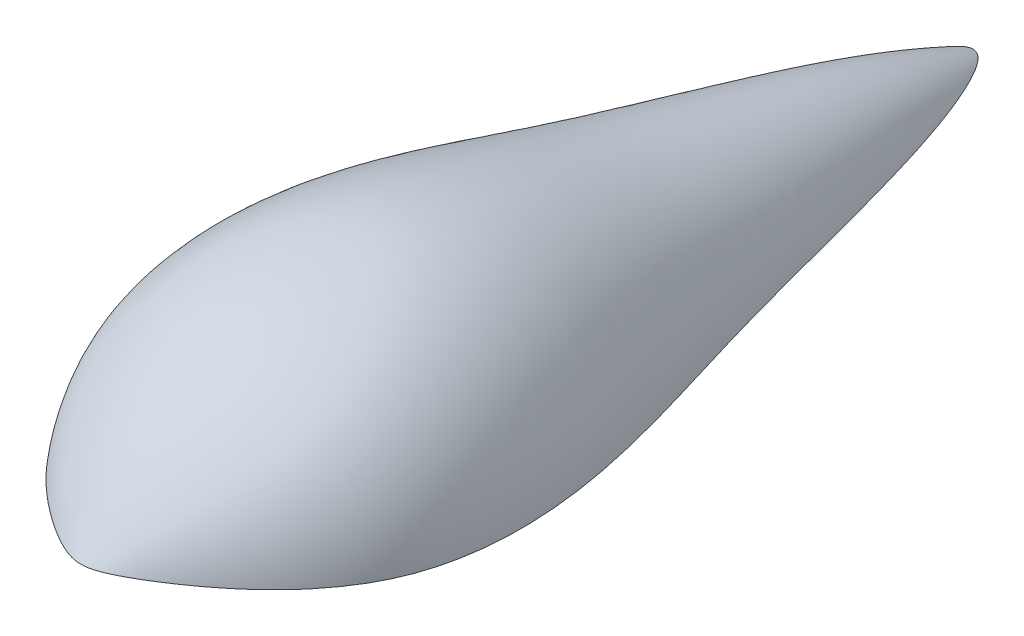
ISO-10303-21;
HEADER;
FILE_DESCRIPTION(('STEP AP214'),'2;1');
FILE_NAME('part.step','',(''),(''),'','','');
FILE_SCHEMA(('AUTOMOTIVE_DESIGN { 1 0 10303 214 1 1 1 1 }'));
ENDSEC;
DATA;
#1=APPLICATION_CONTEXT('core data for automotive mechanical design processes');
#2=APPLICATION_PROTOCOL_DEFINITION('international standard','automotive_design',2000,#1);
#3=PRODUCT_CONTEXT('',#1,'mechanical');
#4=PRODUCT('Part','Part','',(#3));
#5=PRODUCT_RELATED_PRODUCT_CATEGORY('part','',(#4));
#6=PRODUCT_DEFINITION_FORMATION('','',#4);
#7=PRODUCT_DEFINITION_CONTEXT('part definition',#1,'design');
#8=PRODUCT_DEFINITION('design','',#6,#7);
#9=PRODUCT_DEFINITION_SHAPE('','',#8);
#10=(LENGTH_UNIT() NAMED_UNIT(*) SI_UNIT(.MILLI.,.METRE.));
#11=(NAMED_UNIT(*) PLANE_ANGLE_UNIT() SI_UNIT($,.RADIAN.));
#12=(NAMED_UNIT(*) SI_UNIT($,.STERADIAN.) SOLID_ANGLE_UNIT());
#13=UNCERTAINTY_MEASURE_WITH_UNIT(LENGTH_MEASURE(1.E-05),#10,'distance_accuracy_value','');
#14=(GEOMETRIC_REPRESENTATION_CONTEXT(3) GLOBAL_UNCERTAINTY_ASSIGNED_CONTEXT((#13)) GLOBAL_UNIT_ASSIGNED_CONTEXT((#10,
#11,#12)) REPRESENTATION_CONTEXT('',''));
#15=CARTESIAN_POINT('',(0.,0.,0.));
#16=DIRECTION('',(0.,0.,1.));
#17=DIRECTION('',(1.,0.,0.));
#18=AXIS2_PLACEMENT_3D('',#15,#16,#17);
#19=CARTESIAN_POINT('',(0.,-76.835,127.220331340447));
#20=DIRECTION('',(0.,0.,1.));
#21=DIRECTION('',(1.,0.,0.));
#22=AXIS2_PLACEMENT_3D('',#19,#20,#21);
#23=CYLINDRICAL_SURFACE('',#22,78.359);
#24=CARTESIAN_POINT('',(0.,1.524,-0.948397399508818));
#25=CARTESIAN_POINT('',(-0.0468724664831351,1.52400001148209,-0.94839653140969));
#26=CARTESIAN_POINT('',(-0.0937420457764624,1.52395789879976,-0.94978477246184));
#27=CARTESIAN_POINT('',(-0.187320823556759,1.5237900676111,-0.95528515585639));
#28=CARTESIAN_POINT('',(-0.234030021135715,1.52366434863222,-0.959397313594984));
#29=CARTESIAN_POINT('',(-0.327160473103477,1.52333086640331,-0.970206836169312));
#30=CARTESIAN_POINT('',(-0.373581629656452,1.52312307667716,-0.976905035249299));
#31=CARTESIAN_POINT('',(-0.466012258949463,1.52262790612044,-0.992678070242172));
#32=CARTESIAN_POINT('',(-0.512021729521676,1.52234052487101,-1.00175291866221));
#33=CARTESIAN_POINT('',(-0.686996936048974,1.52109484060708,-1.0405229433433));
#34=CARTESIAN_POINT('',(-0.814330205987715,1.51986831913943,-1.07765657255174));
#35=CARTESIAN_POINT('',(-1.06504595955799,1.51686245351777,-1.16353922723403));
#36=CARTESIAN_POINT('',(-1.18842057983939,1.51508207614661,-1.21230992168091));
#37=CARTESIAN_POINT('',(-1.43273529629423,1.51099658112199,-1.31802958051443));
#38=CARTESIAN_POINT('',(-1.55364787321894,1.50868736295143,-1.37504109626736));
#39=CARTESIAN_POINT('',(-1.79257520612239,1.5035844967381,-1.49453224043359));
#40=CARTESIAN_POINT('',(-1.91059209244117,1.50079121780666,-1.55700768458184));
#41=CARTESIAN_POINT('',(-2.18149810219439,1.49377945673262,-1.70654432106038));
#42=CARTESIAN_POINT('',(-2.33354953190328,1.48939016396966,-1.79510875608527));
#43=CARTESIAN_POINT('',(-2.63445712963331,1.47984640786325,-1.97749561176105));
#44=CARTESIAN_POINT('',(-2.78331262216731,1.47469178454829,-2.07131912912162));
#45=CARTESIAN_POINT('',(-3.07842674846754,1.46364622970289,-2.26338686260899));
#46=CARTESIAN_POINT('',(-3.22468118173884,1.4577542123507,-2.36163745823452));
#47=CARTESIAN_POINT('',(-3.51457900619889,1.4452763392833,-2.56188145622178));
#48=CARTESIAN_POINT('',(-3.65822223187187,1.43869043976378,-2.66387509461408));
#49=CARTESIAN_POINT('',(-4.08558848964788,1.41793763295526,-2.9751105612292));
#50=CARTESIAN_POINT('',(-4.36555162493475,1.40278308148684,-3.18947780916565));
#51=CARTESIAN_POINT('',(-4.91512829798132,1.3701793816827,-3.63051302818717));
#52=CARTESIAN_POINT('',(-5.18474886687822,1.35273182922738,-3.85717238037135));
#53=CARTESIAN_POINT('',(-5.71286375532187,1.31591842474876,-4.32238468222069));
#54=CARTESIAN_POINT('',(-5.97137023310005,1.29655474962694,-4.56092398542693));
#55=CARTESIAN_POINT('',(-6.47650089672971,1.25630538406754,-5.04999524826912));
#56=CARTESIAN_POINT('',(-6.72312931888934,1.23542024303881,-5.3005228677612));
#57=CARTESIAN_POINT('',(-7.14382423373808,1.19788750752361,-5.74996560634522));
#58=CARTESIAN_POINT('',(-7.32071243685081,1.18147413781611,-5.94626485695775));
#59=CARTESIAN_POINT('',(-7.66663162513751,1.14824074002578,-6.34566223859913));
#60=CARTESIAN_POINT('',(-7.83566222496785,1.13142069206045,-6.54876070222883));
#61=CARTESIAN_POINT('',(-8.16553892135772,1.09756290270887,-6.96166644117686));
#62=CARTESIAN_POINT('',(-8.32638047769308,1.08052504697405,-7.17147733530819));
#63=CARTESIAN_POINT('',(-8.63932502246287,1.04644655671913,-7.59751842212136));
#64=CARTESIAN_POINT('',(-8.79142813416146,1.02940592224162,-7.8137485241888));
#65=CARTESIAN_POINT('',(-9.08578302443597,0.995606347140301,-8.25153829866445));
#66=CARTESIAN_POINT('',(-9.22807290085769,0.978846533678834,-8.47307226655949));
#67=CARTESIAN_POINT('',(-9.50294130065644,0.945756942735801,-8.92212746921113));
#68=CARTESIAN_POINT('',(-9.63551967911451,0.929427171673833,-9.14964879324469));
#69=CARTESIAN_POINT('',(-9.89030533542956,0.897433508869478,-9.61033289387004));
#70=CARTESIAN_POINT('',(-10.0125176633791,0.881769294761585,-9.84349285147334));
#71=CARTESIAN_POINT('',(-10.2460081377779,0.851331241758164,-10.3152793092441));
#72=CARTESIAN_POINT('',(-10.3572866510627,0.83655737299749,-10.5539056256807));
#73=CARTESIAN_POINT('',(-10.5679561659001,0.808173857334879,-11.0356707505229));
#74=CARTESIAN_POINT('',(-10.667377956593,0.794561222392509,-11.2787958899365));
#75=CARTESIAN_POINT('',(-10.8540293679216,0.768684413883579,-11.7697507176146));
#76=CARTESIAN_POINT('',(-10.9412589673749,0.756420242659813,-12.0175804140518));
#77=CARTESIAN_POINT('',(-11.1039925878036,0.733298782173674,-12.5171691723002));
#78=CARTESIAN_POINT('',(-11.1794941250644,0.722441790997769,-12.7689290540382));
#79=CARTESIAN_POINT('',(-11.3192357652562,0.702170227996523,-13.2756099912637));
#80=CARTESIAN_POINT('',(-11.3834755393843,0.692755698286877,-13.5305311388161));
#81=CARTESIAN_POINT('',(-11.5013750780463,0.675352959743695,-14.043503662658));
#82=CARTESIAN_POINT('',(-11.5550086967674,0.667368280173418,-14.30156115002));
#83=CARTESIAN_POINT('',(-11.6520631199199,0.652835738325076,-14.8196082987281));
#84=CARTESIAN_POINT('',(-11.6954840546758,0.646287857712032,-15.0795979353742));
#85=CARTESIAN_POINT('',(-11.8112997209692,0.628748672733815,-15.8617791508864));
#86=CARTESIAN_POINT('',(-11.869250132937,0.619861403826584,-16.3861955899458));
#87=CARTESIAN_POINT('',(-11.9541002845169,0.606812219244942,-17.4764170380482));
#88=CARTESIAN_POINT('',(-11.978393551766,0.6030473333284,-18.042420948851));
#89=CARTESIAN_POINT('',(-11.9891857757004,0.601375445955508,-18.8917619212849));
#90=CARTESIAN_POINT('',(-11.9885046272374,0.601481335107266,-19.1750141000903));
#91=CARTESIAN_POINT('',(-11.9791522245257,0.602928910859209,-19.741389945042));
#92=CARTESIAN_POINT('',(-11.9704810141381,0.604270590675601,-20.0245136118851));
#93=CARTESIAN_POINT('',(-11.9455362182696,0.608122352284757,-20.5904570062297));
#94=CARTESIAN_POINT('',(-11.9292614325166,0.610632618546037,-20.8732766786764));
#95=CARTESIAN_POINT('',(-11.8895298908439,0.616742129685971,-21.4383917736457));
#96=CARTESIAN_POINT('',(-11.8660731399999,0.620341373795026,-21.7206871965386));
#97=CARTESIAN_POINT('',(-11.7853889580282,0.632673860885607,-22.5686421833975));
#98=CARTESIAN_POINT('',(-11.7179436129135,0.642926780855101,-23.1333273772363));
#99=CARTESIAN_POINT('',(-11.559633868451,0.666703850497405,-24.2590785237115));
#100=CARTESIAN_POINT('',(-11.4687765454067,0.680227011659339,-24.8201455175215));
#101=CARTESIAN_POINT('',(-11.2674591442417,0.709745614010291,-25.9385352374971));
#102=CARTESIAN_POINT('',(-11.1570029102363,0.725740570304062,-26.4958586757134));
#103=CARTESIAN_POINT('',(-10.9244823242073,0.758826082190511,-27.5871249703494));
#104=CARTESIAN_POINT('',(-10.8029758550672,0.775856829765135,-28.1211899303528));
#105=CARTESIAN_POINT('',(-10.548520324215,0.810850384148069,-29.1865157198719));
#106=CARTESIAN_POINT('',(-10.4155716163274,0.828813162128711,-29.7177766355572));
#107=CARTESIAN_POINT('',(-10.141387672588,0.865091747573521,-30.7782791921675));
#108=CARTESIAN_POINT('',(-10.0001502071593,0.883407649125835,-31.3075202486241));
#109=CARTESIAN_POINT('',(-9.71250114477792,0.919879126060946,-32.3647558950724));
#110=CARTESIAN_POINT('',(-9.56608804463688,0.938034652919531,-32.8927500746308));
#111=CARTESIAN_POINT('',(-9.27118129750362,0.973740654235605,-33.9482569608583));
#112=CARTESIAN_POINT('',(-9.12268734995157,0.991291039992118,-34.4757695860023));
#113=CARTESIAN_POINT('',(-8.90072113291136,1.01688260638653,-35.2672616722052));
#114=CARTESIAN_POINT('',(-8.82686389770147,1.025290531961,-35.53112098482));
#115=CARTESIAN_POINT('',(-8.67978529401402,1.04182372818652,-36.0590254994262));
#116=CARTESIAN_POINT('',(-8.60656392445709,1.04994899931745,-36.3230707011012));
#117=CARTESIAN_POINT('',(-8.46135931493539,1.06585754383836,-36.8508434212048));
#118=CARTESIAN_POINT('',(-8.38937356719883,1.07364157691192,-37.1145702253812));
#119=CARTESIAN_POINT('',(-8.24669339931136,1.08887364339051,-37.6423827584224));
#120=CARTESIAN_POINT('',(-8.17599898001978,1.09632167657194,-37.9064684875259));
#121=CARTESIAN_POINT('',(-8.03571450841512,1.11091165071627,-38.4348965340667));
#122=CARTESIAN_POINT('',(-7.96612428343592,1.11805363983923,-38.6992388043888));
#123=CARTESIAN_POINT('',(-7.82790814487641,1.1320543118083,-39.228182815809));
#124=CARTESIAN_POINT('',(-7.75928223188253,1.13891299448214,-39.4927845570646));
#125=CARTESIAN_POINT('',(-7.55463727682011,1.15909691164179,-40.2868747940556));
#126=CARTESIAN_POINT('',(-7.41984049825899,1.17203110721229,-40.8166881078368));
#127=CARTESIAN_POINT('',(-7.15232193022115,1.19701402623629,-41.8768385049345));
#128=CARTESIAN_POINT('',(-7.01960007356216,1.2090627784058,-42.4071755706993));
#129=CARTESIAN_POINT('',(-6.75500310712789,1.23240967385989,-43.4680656145658));
#130=CARTESIAN_POINT('',(-6.62312798064113,1.24370783199995,-43.9986185881851));
#131=CARTESIAN_POINT('',(-6.35896890504119,1.26566559628133,-45.0596254607856));
#132=CARTESIAN_POINT('',(-6.22668496389839,1.27632521479026,-45.5900793614871));
#133=CARTESIAN_POINT('',(-5.99331308972708,1.294528180456,-46.5195410389192));
#134=CARTESIAN_POINT('',(-5.89259407865054,1.30219067319283,-46.9186389191839));
#135=CARTESIAN_POINT('',(-5.68962335222698,1.31723239626547,-47.7164605178853));
#136=CARTESIAN_POINT('',(-5.5873716021928,1.32461162017717,-48.1151842276366));
#137=CARTESIAN_POINT('',(-5.38073880908328,1.33910860039987,-48.9121173872298));
#138=CARTESIAN_POINT('',(-5.27635760620179,1.3462263369743,-49.3103267960736));
#139=CARTESIAN_POINT('',(-5.06487825134375,1.36021167381201,-50.1060945678907));
#140=CARTESIAN_POINT('',(-4.95777968794152,1.36707923580923,-50.5036528224572));
#141=CARTESIAN_POINT('',(-4.73984109623148,1.38059136178297,-51.2985258178379));
#142=CARTESIAN_POINT('',(-4.62899462622143,1.38723549811745,-51.6958388051411));
#143=CARTESIAN_POINT('',(-4.40274868682945,1.40029591768544,-52.4891603294755));
#144=CARTESIAN_POINT('',(-4.28734936980318,1.4067122085299,-52.8851689096775));
#145=CARTESIAN_POINT('',(-4.05094044949312,1.41930833796559,-53.6754186554075));
#146=CARTESIAN_POINT('',(-3.92993212713858,1.42548822996057,-54.0696602021385));
#147=CARTESIAN_POINT('',(-3.68106627261295,1.4375888730852,-54.8558670406615));
#148=CARTESIAN_POINT('',(-3.55321072872294,1.44350969854434,-55.2478329569944));
#149=CARTESIAN_POINT('',(-3.33226117997174,1.45316520197295,-55.9011578789193));
#150=CARTESIAN_POINT('',(-3.24147780955582,1.45698142850046,-56.1632968830743));
#151=CARTESIAN_POINT('',(-3.05544602400651,1.46446238066686,-56.6860614719576));
#152=CARTESIAN_POINT('',(-2.96019659145828,1.46812707142299,-56.9466866964841));
#153=CARTESIAN_POINT('',(-2.76437549080505,1.4752848653599,-57.4661494425736));
#154=CARTESIAN_POINT('',(-2.66380007783706,1.47877784438581,-57.7249855576222));
#155=CARTESIAN_POINT('',(-2.45652826968123,1.48555351859386,-58.2394191747911));
#156=CARTESIAN_POINT('',(-2.34984890363893,1.48883674944417,-58.4950234701779));
#157=CARTESIAN_POINT('',(-2.1837258189012,1.49358528672758,-58.87569584183));
#158=CARTESIAN_POINT('',(-2.1273479330358,1.4951384070775,-59.0021018857335));
#159=CARTESIAN_POINT('',(-2.01220038783335,1.49818105124952,-59.2538183822221));
#160=CARTESIAN_POINT('',(-1.95343082917842,1.49967057774333,-59.3791288806571));
#161=CARTESIAN_POINT('',(-1.83309849527471,1.50257878275546,-59.6282488542885));
#162=CARTESIAN_POINT('',(-1.77153863272742,1.50399753204666,-59.7520597312144));
#163=CARTESIAN_POINT('',(-1.64491659853824,1.50675864959359,-59.9978706699493));
#164=CARTESIAN_POINT('',(-1.57985490049103,1.50810102812758,-60.1198709737908));
#165=CARTESIAN_POINT('',(-1.46286747731338,1.51035955262588,-60.3296944273736));
#166=CARTESIAN_POINT('',(-1.41197180778172,1.51129515138465,-60.418089471273));
#167=CARTESIAN_POINT('',(-1.30707744800878,1.51311539075373,-60.5930906516168));
#168=CARTESIAN_POINT('',(-1.25307715713129,1.51400000459874,-60.679695833417));
#169=CARTESIAN_POINT('',(-1.1409320237417,1.51571360122258,-60.8506067064321));
#170=CARTESIAN_POINT('',(-1.08277490827024,1.51654240394529,-60.9349044787709));
#171=CARTESIAN_POINT('',(-0.991515475164279,1.51773253591835,-61.0583319504734));
#172=CARTESIAN_POINT('',(-0.960437322645537,1.51812026709845,-61.0989567190099));
#173=CARTESIAN_POINT('',(-0.896677763222452,1.5188758995006,-61.1789234146186));
#174=CARTESIAN_POINT('',(-0.863996673468273,1.51924380461535,-61.2182655929147));
#175=CARTESIAN_POINT('',(-0.796230377759706,1.51996195683433,-61.295835829354));
#176=CARTESIAN_POINT('',(-0.761117423023285,1.52031187518076,-61.3340398298019));
#177=CARTESIAN_POINT('',(-0.688515819293805,1.52098346584493,-61.4081017298773));
#178=CARTESIAN_POINT('',(-0.651028637484006,1.5213051553194,-61.4439610511112));
#179=CARTESIAN_POINT('',(-0.57342812099367,1.52191135721029,-61.5121831461034));
#180=CARTESIAN_POINT('',(-0.533335219070676,1.52219611630685,-61.5445688405103));
#181=CARTESIAN_POINT('',(-0.449824507717017,1.52271996051572,-61.6046561089068));
#182=CARTESIAN_POINT('',(-0.406414192743658,1.52295914455001,-61.6323678125492));
#183=CARTESIAN_POINT('',(-0.323896320469744,1.52333942106105,-61.6767250525025));
#184=CARTESIAN_POINT('',(-0.285386654372291,1.52349038171254,-61.694461061078));
#185=CARTESIAN_POINT('',(-0.206079666649588,1.52373899933512,-61.7237829110424));
#186=CARTESIAN_POINT('',(-0.165285625701362,1.52383673069022,-61.7353773342192));
#187=CARTESIAN_POINT('',(-0.0817848922628741,1.52396851237134,-61.7510325435912));
#188=CARTESIAN_POINT('',(-0.0390629035217387,1.52400190107103,-61.755015054208));
#189=CARTESIAN_POINT('',(0.0463469663572763,1.52399792965116,-61.7545420603936));
#190=CARTESIAN_POINT('',(0.0890348361184609,1.52396055161365,-61.7500844189394));
#191=CARTESIAN_POINT('',(0.167793408942823,1.52382907710515,-61.7344704329201));
#192=CARTESIAN_POINT('',(0.204044763138016,1.5237423015209,-61.7241793354485));
#193=CARTESIAN_POINT('',(0.274751941657951,1.52352629934616,-61.6986914225097));
#194=CARTESIAN_POINT('',(0.309207209350898,1.52339705968503,-61.6834930966002));
#195=CARTESIAN_POINT('',(0.374106528896515,1.52311327094051,-61.650323095003));
#196=CARTESIAN_POINT('',(0.404667154143173,1.52296072356877,-61.6325745485318));
#197=CARTESIAN_POINT('',(0.464129441442406,1.52263108680618,-61.5944644871982));
#198=CARTESIAN_POINT('',(0.493029668361854,1.52245397662319,-61.5741007597064));
#199=CARTESIAN_POINT('',(0.549396474705591,1.52207908189851,-61.5312875101675));
#200=CARTESIAN_POINT('',(0.576857284419299,1.52188122246957,-61.5088304678414));
#201=CARTESIAN_POINT('',(0.630390516450103,1.5214688047327,-61.4623500435018));
#202=CARTESIAN_POINT('',(0.656463415280328,1.52125425221911,-61.4383272054588));
#203=CARTESIAN_POINT('',(0.735371497092838,1.52056761543455,-61.3620023916471));
#204=CARTESIAN_POINT('',(0.786172816461445,1.52007132341177,-61.3076001227529));
#205=CARTESIAN_POINT('',(0.883846069411396,1.51903039342239,-61.1952681333518));
#206=CARTESIAN_POINT('',(0.930709894343189,1.51848566022562,-61.1373315381821));
#207=CARTESIAN_POINT('',(1.02136882354143,1.51735632620857,-61.0190293987421));
#208=CARTESIAN_POINT('',(1.06516083394579,1.51677168633182,-60.9586614993518));
#209=CARTESIAN_POINT('',(1.15050063909049,1.51556514458838,-60.8358849470182));
#210=CARTESIAN_POINT('',(1.19203488486023,1.51494305681322,-60.773466956278));
#211=CARTESIAN_POINT('',(1.2730178991569,1.51366905821998,-60.6474161036486));
#212=CARTESIAN_POINT('',(1.31246937117713,1.5130171882192,-60.5837849702418));
#213=CARTESIAN_POINT('',(1.38967009183285,1.5116858694266,-60.4555449874786));
#214=CARTESIAN_POINT('',(1.42742016052268,1.51100643422752,-60.3909366296289));
#215=CARTESIAN_POINT('',(1.50769516031097,1.50950591657647,-60.250034128684));
#216=CARTESIAN_POINT('',(1.54996223945689,1.50868015441668,-60.1735934080642));
#217=CARTESIAN_POINT('',(1.63286571098243,1.50699605830857,-60.0198315734099));
#218=CARTESIAN_POINT('',(1.67350201714134,1.50613772264272,-59.9425104131024));
#219=CARTESIAN_POINT('',(1.79334071155933,1.50351679426169,-59.7094421355619));
#220=CARTESIAN_POINT('',(1.87045544472393,1.50170861177109,-59.5526213308713));
#221=CARTESIAN_POINT('',(2.02053581282705,1.49798121685375,-59.2366620026523));
#222=CARTESIAN_POINT('',(2.09349329986388,1.49606180032056,-59.0775196469201));
#223=CARTESIAN_POINT('',(2.23591258404599,1.49212588454275,-58.7576747828351));
#224=CARTESIAN_POINT('',(2.30537421868805,1.49010938079357,-58.5969722023693));
#225=CARTESIAN_POINT('',(2.44142105164584,1.48598683185552,-58.2741876698705));
#226=CARTESIAN_POINT('',(2.50800358951071,1.48388070727219,-58.1121046009861));
#227=CARTESIAN_POINT('',(2.63862905688315,1.47958856543067,-57.7869171275934));
#228=CARTESIAN_POINT('',(2.70267191830706,1.47740254603368,-57.62381269584));
#229=CARTESIAN_POINT('',(2.89138139749272,1.47073842946389,-57.1334396490902));
#230=CARTESIAN_POINT('',(3.012720881112,1.4661514386941,-56.8048903842626));
#231=CARTESIAN_POINT('',(3.24811632312118,1.45673933736487,-56.1456955489252));
#232=CARTESIAN_POINT('',(3.36218151572627,1.45191454306178,-55.8150532464594));
#233=CARTESIAN_POINT('',(3.5843303891421,1.44205799329014,-55.1519945665638));
#234=CARTESIAN_POINT('',(3.69241762460888,1.43702636398321,-54.819579375141));
#235=CARTESIAN_POINT('',(3.90263475560902,1.42682526025132,-54.1562903294098));
#236=CARTESIAN_POINT('',(4.0048108281863,1.42165751015065,-53.8254310354612));
#237=CARTESIAN_POINT('',(4.20503836327019,1.4111536475177,-53.1624672343577));
#238=CARTESIAN_POINT('',(4.3030897593228,1.40581753227523,-52.8303627072343));
#239=CARTESIAN_POINT('',(4.59214243489316,1.3895647402661,-51.8322701358992));
#240=CARTESIAN_POINT('',(4.77795460989626,1.37840794114761,-51.1647836095244));
#241=CARTESIAN_POINT('',(5.04988865912636,1.36116153298725,-50.161537354633));
#242=CARTESIAN_POINT('',(5.1394285230064,1.35532569834006,-49.8266849446071));
#243=CARTESIAN_POINT('',(5.31666707627031,1.34347422293196,-49.1564947210746));
#244=CARTESIAN_POINT('',(5.40436576481521,1.33745858208913,-48.8211569073469));
#245=CARTESIAN_POINT('',(5.66530676446965,1.31912759159994,-47.814257826806));
#246=CARTESIAN_POINT('',(5.83631022138151,1.30653351902441,-47.1421228034978));
#247=CARTESIAN_POINT('',(6.17515779343396,1.28048603567466,-45.7969209739043));
#248=CARTESIAN_POINT('',(6.34300119976311,1.26703243500936,-45.1238539940826));
#249=CARTESIAN_POINT('',(6.67811461145613,1.2390927155011,-43.7776568260867));
#250=CARTESIAN_POINT('',(6.84538466244335,1.22460668090913,-43.1045266475366));
#251=CARTESIAN_POINT('',(7.09768283440592,1.20193270651916,-42.0956310257001));
#252=CARTESIAN_POINT('',(7.18196313325081,1.19422216494586,-41.7596682401595));
#253=CARTESIAN_POINT('',(7.35133025087011,1.17844798463561,-41.0879538383142));
#254=CARTESIAN_POINT('',(7.43641707017537,1.17038434566625,-40.7522022221488));
#255=CARTESIAN_POINT('',(7.60767496239873,1.15386817319227,-40.0810988278378));
#256=CARTESIAN_POINT('',(7.69384568111981,1.14541576444845,-39.7457469563657));
#257=CARTESIAN_POINT('',(7.86759977107407,1.12807701238528,-39.0754207824356));
#258=CARTESIAN_POINT('',(7.95518314019122,1.11919066971588,-38.740446479413));
#259=CARTESIAN_POINT('',(8.13203153560474,1.10094066634462,-38.0710214324771));
#260=CARTESIAN_POINT('',(8.2212962434965,1.09157709545645,-37.7365706021695));
#261=CARTESIAN_POINT('',(8.35670607347997,1.07713257074614,-37.2353148571116));
#262=CARTESIAN_POINT('',(8.4020948165999,1.07225120055135,-37.06829967372));
#263=CARTESIAN_POINT('',(8.4933605658721,1.06235435211383,-36.734406704741));
#264=CARTESIAN_POINT('',(8.53923757223984,1.05733887381192,-36.5675289192143));
#265=CARTESIAN_POINT('',(8.67742761159984,1.04210646669821,-36.0670643883605));
#266=CARTESIAN_POINT('',(8.77030185125984,1.03170333267447,-35.733638409426));
#267=CARTESIAN_POINT('',(8.95676998080582,1.01047489453037,-35.0670013407202));
#268=CARTESIAN_POINT('',(9.05036387242191,0.999649589394822,-34.7337902514677));
#269=CARTESIAN_POINT('',(9.23749063559817,0.977662952432872,-34.0673582437689));
#270=CARTESIAN_POINT('',(9.33102350660932,0.966501617624568,-33.7341373252617));
#271=CARTESIAN_POINT('',(9.51725277018501,0.943940615304212,-33.067470666765));
#272=CARTESIAN_POINT('',(9.60994916168777,0.932540947489693,-32.7340249264908));
#273=CARTESIAN_POINT('',(9.88563266465879,0.898141390753591,-31.7329905661999));
#274=CARTESIAN_POINT('',(10.0662064432601,0.874941850732371,-31.0647316126774));
#275=CARTESIAN_POINT('',(10.3342178396086,0.839615368424783,-30.03411341981));
#276=CARTESIAN_POINT('',(10.4261717513267,0.827320501731919,-29.672938499694));
#277=CARTESIAN_POINT('',(10.6053843701539,0.803050299861635,-28.9494363715228));
#278=CARTESIAN_POINT('',(10.6926433960454,0.791074943017434,-28.5871092434761));
#279=CARTESIAN_POINT('',(10.8614489608937,0.767635760471982,-27.8611253644803));
#280=CARTESIAN_POINT('',(10.9429958103346,0.75617190698041,-27.4974686869309));
#281=CARTESIAN_POINT('',(11.0993499845221,0.733959943505134,-26.7686456711202));
#282=CARTESIAN_POINT('',(11.1741566842586,0.723211899922118,-26.4034791961334));
#283=CARTESIAN_POINT('',(11.3161175501676,0.702626499754891,-25.6708091071764));
#284=CARTESIAN_POINT('',(11.383254838142,0.692791160365552,-25.3033021487348));
#285=CARTESIAN_POINT('',(11.5086205317577,0.674280425915454,-24.5666882449862));
#286=CARTESIAN_POINT('',(11.566847843528,0.665605173294121,-24.1975811089379));
#287=CARTESIAN_POINT('',(11.673300093396,0.649642666199501,-23.4579025189119));
#288=CARTESIAN_POINT('',(11.7215255075469,0.642355345667144,-23.087331135483));
#289=CARTESIAN_POINT('',(11.806910344872,0.629389288690273,-22.3448825476645));
#290=CARTESIAN_POINT('',(11.844069598911,0.623710576831773,-21.9730053234043));
#291=CARTESIAN_POINT('',(11.9173947652053,0.612469067540314,-21.09504634601));
#292=CARTESIAN_POINT('',(11.9484581421042,0.607673216308523,-20.5885062549459));
#293=CARTESIAN_POINT('',(11.9765059720569,0.603338381295354,-19.8279924328949));
#294=CARTESIAN_POINT('',(11.9827637262218,0.602369974996935,-19.5743439155941));
#295=CARTESIAN_POINT('',(11.9888047603923,0.601434873633254,-19.0669694377283));
#296=CARTESIAN_POINT('',(11.9885880532925,0.601468176572966,-18.8132434773187));
#297=CARTESIAN_POINT('',(11.9775839695099,0.603172199656008,-18.051873245539));
#298=CARTESIAN_POINT('',(11.9564311811245,0.606448808169416,-17.5443233001419));
#299=CARTESIAN_POINT('',(11.8830642567206,0.617740821449344,-16.5343503477584));
#300=CARTESIAN_POINT('',(11.831026302078,0.625729345968167,-16.031914576018));
#301=CARTESIAN_POINT('',(11.692157128841,0.646812795417652,-15.0321381412563));
#302=CARTESIAN_POINT('',(11.6053432601485,0.659905173919198,-14.5347950641649));
#303=CARTESIAN_POINT('',(11.3929876472516,0.691410454773229,-13.5490908538631));
#304=CARTESIAN_POINT('',(11.2674940693818,0.709816738131722,-13.0607193457109));
#305=CARTESIAN_POINT('',(11.0224338967891,0.744949626119773,-12.2559468731106));
#306=CARTESIAN_POINT('',(10.9145460956441,0.760230375604002,-11.9359176348872));
#307=CARTESIAN_POINT('',(10.7376675353382,0.784835745262712,-11.4615792221591));
#308=CARTESIAN_POINT('',(10.6761939264134,0.793319091377171,-11.3044032818573));
#309=CARTESIAN_POINT('',(10.548329613441,0.810796988883584,-10.9920924906136));
#310=CARTESIAN_POINT('',(10.4819388035568,0.819791551277852,-10.8369576836892));
#311=CARTESIAN_POINT('',(10.2756880942784,0.847445653339363,-10.374758253662));
#312=CARTESIAN_POINT('',(10.1287381647889,0.866777257003873,-10.0708672515685));
#313=CARTESIAN_POINT('',(9.81708879327438,0.906767192457532,-9.47181354754614));
#314=CARTESIAN_POINT('',(9.65235978783917,0.927427710212653,-9.17666645671912));
#315=CARTESIAN_POINT('',(9.3066224414947,0.969562737075809,-8.59609525572517));
#316=CARTESIAN_POINT('',(9.12561261691268,0.991037320266337,-8.31067203497005));
#317=CARTESIAN_POINT('',(8.74852181770138,1.03432819268902,-7.75003986298299));
#318=CARTESIAN_POINT('',(8.55244133101304,1.05614447083997,-7.47483058148307));
#319=CARTESIAN_POINT('',(8.0470980982099,1.11029774489232,-6.803251993219));
#320=CARTESIAN_POINT('',(7.72928457754124,1.14257525714658,-6.41327109573776));
#321=CARTESIAN_POINT('',(7.06553848648034,1.2055157916084,-5.65799347316039));
#322=CARTESIAN_POINT('',(6.71960465284759,1.23617874118337,-5.29269785834539));
#323=CARTESIAN_POINT('',(6.00364827049992,1.29449462240941,-4.58719954251891));
#324=CARTESIAN_POINT('',(5.63365616301494,1.32215124395907,-4.24696624985642));
#325=CARTESIAN_POINT('',(5.06257380072601,1.36052214993764,-3.75532679471209));
#326=CARTESIAN_POINT('',(4.86954321516895,1.37279277783507,-3.59457485386463));
#327=CARTESIAN_POINT('',(4.47830576679766,1.39617053825496,-3.27941886004972));
#328=CARTESIAN_POINT('',(4.28009931661232,1.4072777631743,-3.12501430356886));
#329=CARTESIAN_POINT('',(3.91530773317313,1.42629463792471,-2.85050527698998));
#330=CARTESIAN_POINT('',(3.74956725897641,1.43441760915808,-2.72929128574998));
#331=CARTESIAN_POINT('',(3.4146113659381,1.44974576131998,-2.49169266469334));
#332=CARTESIAN_POINT('',(3.24539591737673,1.45695093439522,-2.375308076206));
#333=CARTESIAN_POINT('',(2.90296867333417,1.47039622382364,-2.14786228050881));
#334=CARTESIAN_POINT('',(2.72975085193562,1.47663475904388,-2.03680999587899));
#335=CARTESIAN_POINT('',(2.4667281387958,1.48521335174974,-1.87544526450892));
#336=CARTESIAN_POINT('',(2.37852965167796,1.48794279503514,-1.82253068403546));
#337=CARTESIAN_POINT('',(2.20093597317911,1.49313450285838,-1.71873969267028));
#338=CARTESIAN_POINT('',(2.11154084094544,1.49559678054721,-1.66786318153424));
#339=CARTESIAN_POINT('',(1.91592983366286,1.50064477857635,-1.56003581365382));
#340=CARTESIAN_POINT('',(1.80945989706381,1.50317917613083,-1.50354073644829));
#341=CARTESIAN_POINT('',(1.59423357539052,1.50785475825443,-1.39490645354745));
#342=CARTESIAN_POINT('',(1.48547625255634,1.50999577790483,-1.34276907973449));
#343=CARTESIAN_POINT('',(1.26559598984394,1.51385581045413,-1.24467103756274));
#344=CARTESIAN_POINT('',(1.15448184342546,1.51557616647356,-1.19869092839933));
#345=CARTESIAN_POINT('',(0.92908614866174,1.51857268884823,-1.11530187690687));
#346=CARTESIAN_POINT('',(0.814808021033358,1.51984931613458,-1.0778840542424));
#347=CARTESIAN_POINT('',(0.6418716722373,1.52139176823194,-1.03122773682831));
#348=CARTESIAN_POINT('',(0.584470495604516,1.52184153022522,-1.01733373554601));
#349=CARTESIAN_POINT('',(0.46892616352803,1.52261817110115,-0.993022011575373));
#350=CARTESIAN_POINT('',(0.410783037952448,1.52294505491439,-0.982604149406025));
#351=CARTESIAN_POINT('',(0.294022789274428,1.52347008006336,-0.965725900592134));
#352=CARTESIAN_POINT('',(0.235406693051394,1.52366844932698,-0.959258508734274));
#353=CARTESIAN_POINT('',(0.117858849715579,1.52393339378685,-0.950595072573447));
#354=CARTESIAN_POINT('',(0.0589271432525763,1.52399998556495,-0.948398490865973));
#355=CARTESIAN_POINT('',(0.,1.524,-0.948397399508818));
#356=B_SPLINE_CURVE_WITH_KNOTS('',3,(#24,#25,#26,#27,#28,#29,#30,#31,#32,#33,#34,#35,#36,#37,
#38,#39,#40,#41,#42,#43,#44,#45,#46,#47,#48,#49,#50,#51,#52,#53,#54,#55,#56,#57,#58,#59,#60,#61,
#62,#63,#64,#65,#66,#67,#68,#69,#70,#71,#72,#73,#74,#75,#76,#77,#78,#79,#80,#81,#82,#83,#84,#85,
#86,#87,#88,#89,#90,#91,#92,#93,#94,#95,#96,#97,#98,#99,#100,#101,#102,#103,#104,#105,#106,#107,
#108,#109,#110,#111,#112,#113,#114,#115,#116,#117,#118,#119,#120,#121,#122,#123,#124,#125,#126,
#127,#128,#129,#130,#131,#132,#133,#134,#135,#136,#137,#138,#139,#140,#141,#142,#143,#144,#145,
#146,#147,#148,#149,#150,#151,#152,#153,#154,#155,#156,#157,#158,#159,#160,#161,#162,#163,#164,
#165,#166,#167,#168,#169,#170,#171,#172,#173,#174,#175,#176,#177,#178,#179,#180,#181,#182,#183,
#184,#185,#186,#187,#188,#189,#190,#191,#192,#193,#194,#195,#196,#197,#198,#199,#200,#201,#202,
#203,#204,#205,#206,#207,#208,#209,#210,#211,#212,#213,#214,#215,#216,#217,#218,#219,#220,#221,
#222,#223,#224,#225,#226,#227,#228,#229,#230,#231,#232,#233,#234,#235,#236,#237,#238,#239,#240,
#241,#242,#243,#244,#245,#246,#247,#248,#249,#250,#251,#252,#253,#254,#255,#256,#257,#258,#259,
#260,#261,#262,#263,#264,#265,#266,#267,#268,#269,#270,#271,#272,#273,#274,#275,#276,#277,#278,
#279,#280,#281,#282,#283,#284,#285,#286,#287,#288,#289,#290,#291,#292,#293,#294,#295,#296,#297,
#298,#299,#300,#301,#302,#303,#304,#305,#306,#307,#308,#309,#310,#311,#312,#313,#314,#315,#316,
#317,#318,#319,#320,#321,#322,#323,#324,#325,#326,#327,#328,#329,#330,#331,#332,#333,#334,#335,
#336,#337,#338,#339,#340,#341,#342,#343,#344,#345,#346,#347,#348,#349,#350,#351,#352,#353,#354,
#355),.UNSPECIFIED.,.T.,.F.,(4,2,2,2,2,2,2,2,2,2,2,2,2,2,2,2,2,2,2,2,2,2,2,2,2,2,2,2,2,2,2,2,2,
2,2,2,2,2,2,2,2,2,2,2,2,2,2,2,2,2,2,2,2,2,2,2,2,2,2,2,2,2,2,2,2,2,2,2,2,2,2,2,2,2,2,2,2,2,2,2,2,
2,2,2,2,2,2,2,2,2,2,2,2,2,2,2,2,2,2,2,2,2,2,2,2,2,2,2,2,2,2,2,2,2,2,2,2,2,2,2,2,2,2,2,2,2,2,2,2,
2,2,2,2,2,2,2,2,2,2,2,2,2,2,2,2,2,2,2,2,2,2,2,2,2,2,2,2,2,2,2,2,2,2,2,2,4),(0.,
0.140592255194995,0.28118530505605,0.421823747493328,0.562462930057565,0.959416219003577,
1.3571145097443,1.75800764274514,2.1585964167141,2.68649986840261,3.21451381968378,
3.74331463354072,4.27214885026213,5.33052220494441,6.3881628167963,7.44461534842102,
8.50068826296664,9.29474875463258,10.088848146717,10.8833831185313,11.6779068799126,
12.4691486806226,13.2604022861634,14.0512681708422,14.8421075124656,15.6308463214207,
16.4195865006928,17.2084934886424,17.9974235060023,18.7882747560866,19.579115913538,
21.1607597099364,22.8591012338513,23.7087678162781,24.5584297345436,25.4082258226411,
26.2580213101728,27.963741600943,29.668946938848,31.3738181880634,33.0175897957603,
34.6613105919284,36.3054755741566,37.9501220683627,39.5950086171525,40.4173984681789,
41.2397869229327,42.0602404348332,42.8806944926995,43.7010189635999,44.5213439333489,
46.1618703172413,47.8023434733385,49.4427841521331,51.0831930476314,52.3182373027534,
53.5533095502728,54.7884748280461,56.0238282470139,57.2614252143083,58.49898080195,
59.7362551480493,60.9731721449014,61.8054605626268,62.6379395142628,63.4710117875843,
64.3018636206173,64.7170965238252,65.1323119650434,65.5471035335021,65.9618391450548,
66.2678035820799,66.5739272036355,66.8809952929055,67.0344154504676,67.1878053744828,
67.3433942984388,67.4988879950885,67.6532827423019,67.8073384555951,67.9341335832328,
68.0607510664072,68.1886637337147,68.3166087924862,68.4292463597809,68.5419186299579,
68.6477812674884,68.7537340698184,68.860083368365,68.9663959152076,69.1893882299095,
69.4128290473241,69.6364917706167,69.8613748743209,70.085958510179,70.3104327160027,
70.5724639939418,70.8345091075528,71.3587062492238,71.8838977405419,72.409113622657,
72.9348048925283,73.4605102456179,74.5112033273821,75.5605349264724,76.6092357034868,
77.6481510543582,78.6870831371295,80.7658287972462,81.8058267778913,82.8458252324175,
84.9267910542627,87.0082182136223,89.0894757137311,90.1288508913179,91.1682267530687,
92.2072713628693,93.2463144164254,94.2851626404484,94.8045868672995,95.3240113233622,
96.3628351741183,97.4016615230851,98.4404970932417,99.4793339818555,101.557091440202,
102.675765108693,103.794362723248,104.912899489454,106.031539870401,107.152596473525,
108.273790597678,109.394931344898,110.516089226737,112.037989076967,112.799098606039,
113.560206619269,115.083282277139,116.597752094693,118.111467273784,119.623305046324,
120.63685709744,121.143725382577,121.650604580584,122.664262535935,123.679632776411,
124.695095641617,125.710525643147,127.221313689579,128.732169642243,130.241149752499,
130.995545502898,131.749881294068,132.366291251067,132.982706482121,133.600119577292,
133.908768287956,134.217401798763,134.578996793123,134.940743037421,135.301318735766,
135.661518752389,135.838612863104,136.015699867015,136.19247193093,136.369221749825),.UNSPECIFIED.);
#357=CARTESIAN_POINT('',(0.,1.524,-0.948397399508818));
#358=VERTEX_POINT('',#357);
#359=EDGE_CURVE('E108',#358,#358,#356,.T.);
#360=ORIENTED_EDGE('',*,*,#359,.T.);
#361=EDGE_LOOP('',(#360));
#362=FACE_BOUND('',#361,.T.);
#363=DIRECTION('',(0.,0.,1.));
#364=VECTOR('',#363,1.);
#365=CARTESIAN_POINT('',(-4.3,1.40592842623993,127.220331340447));
#366=LINE('',#365,#364);
#367=CARTESIAN_POINT('',(-4.3,1.40592842623993,-9.22495156484171));
#368=VERTEX_POINT('',#367);
#369=CARTESIAN_POINT('',(-4.3,1.40592842623993,-10.8212182235556));
#370=VERTEX_POINT('',#369);
#371=EDGE_CURVE('E11',#368,#370,#366,.F.);
#372=ORIENTED_EDGE('',*,*,#371,.F.);
#373=CARTESIAN_POINT('',(0.,-76.835,19.252417483662));
#374=DIRECTION('',(0.,-0.342020143325669,-0.939692620785908));
#375=DIRECTION('',(0.,-0.939692620785908,0.342020143325669));
#376=AXIS2_PLACEMENT_3D('',#373,#374,#375);
#377=ELLIPSE('',#376,83.38790607344,78.359);
#378=CARTESIAN_POINT('',(4.3,1.40592842623993,-9.22495156484171));
#379=VERTEX_POINT('',#378);
#380=EDGE_CURVE('E51',#379,#368,#377,.F.);
#381=ORIENTED_EDGE('',*,*,#380,.F.);
#382=DIRECTION('',(0.,0.,1.));
#383=VECTOR('',#382,1.);
#384=CARTESIAN_POINT('',(4.3,1.40592842623993,127.220331340447));
#385=LINE('',#384,#383);
#386=CARTESIAN_POINT('',(4.3,1.40592842623993,-10.8212182235556));
#387=VERTEX_POINT('',#386);
#388=EDGE_CURVE('E121',#379,#387,#385,.F.);
#389=ORIENTED_EDGE('',*,*,#388,.T.);
#390=CARTESIAN_POINT('',(0.,-76.835,17.6561508249482));
#391=DIRECTION('',(0.,0.34202014332567,0.939692620785908));
#392=DIRECTION('',(0.,-0.939692620785908,0.34202014332567));
#393=AXIS2_PLACEMENT_3D('',#390,#391,#392);
#394=ELLIPSE('',#393,83.38790607344,78.359);
#395=EDGE_CURVE('E213',#370,#387,#394,.F.);
#396=ORIENTED_EDGE('',*,*,#395,.F.);
#397=EDGE_LOOP('',(#372,#381,#389,#396));
#398=FACE_BOUND('',#397,.T.);
#399=ADVANCED_FACE('F41',(#362,#398),#23,.F.);
#400=CARTESIAN_POINT('',(0.,0.,0.));
#401=CARTESIAN_POINT('',(0.,2.80222567489529,-1.66661198079597));
#402=CARTESIAN_POINT('',(0.,7.17927794769284,-4.90327089776023));
#403=CARTESIAN_POINT('',(0.,11.4873572497032,-11.8968133716055));
#404=CARTESIAN_POINT('',(0.,12.7466649350513,-22.8989439366024));
#405=CARTESIAN_POINT('',(0.,8.60444718375306,-35.5914123289828));
#406=CARTESIAN_POINT('',(0.,5.21076469467974,-50.8969147998172));
#407=CARTESIAN_POINT('',(0.,2.45303333606595,-60.2904252120671));
#408=CARTESIAN_POINT('',(0.,0.,-65.));
#409=B_SPLINE_CURVE_WITH_KNOTS('',3,(#400,#401,#402,#403,#404,#405,#406,#407,#408),
.UNSPECIFIED.,.F.,.F.,(4,1,1,1,1,1,4),(0.,0.137797837936204,0.224551314753746,0.337988946133325,
0.590333555688673,0.77750532563608,1.),.UNSPECIFIED.);
#410=CARTESIAN_POINT('',(0.,0.,0.));
#411=DIRECTION('',(0.,0.,1.));
#412=AXIS1_PLACEMENT('',#410,#411);
#413=SURFACE_OF_REVOLUTION('',#409,#412);
#414=ORIENTED_EDGE('',*,*,#359,.F.);
#415=EDGE_LOOP('',(#414));
#416=FACE_BOUND('',#415,.T.);
#417=ADVANCED_FACE('F43',(#416),#413,.F.);
#418=CARTESIAN_POINT('',(-4.3,-2.80037989897145,-7.69398053831865));
#419=DIRECTION('',(0.,-0.342020143325669,-0.939692620785908));
#420=DIRECTION('',(0.,0.939692620785908,-0.342020143325669));
#421=AXIS2_PLACEMENT_3D('',#418,#419,#420);
#422=PLANE('',#421);
#423=ORIENTED_EDGE('',*,*,#380,.T.);
#424=DIRECTION('',(0.,0.939692620785908,-0.342020143325669));
#425=VECTOR('',#424,1.);
#426=CARTESIAN_POINT('',(-4.3,-2.80037989897145,-7.69398053831865));
#427=LINE('',#426,#425);
#428=CARTESIAN_POINT('',(-4.3,9.29523746328147,-12.0964252232522));
#429=VERTEX_POINT('',#428);
#430=EDGE_CURVE('E99',#368,#429,#427,.T.);
#431=ORIENTED_EDGE('',*,*,#430,.T.);
#432=DIRECTION('',(1.,0.,0.));
#433=VECTOR('',#432,1.);
#434=CARTESIAN_POINT('',(-4.3,9.29523746328147,-12.0964252232522));
#435=LINE('',#434,#433);
#436=CARTESIAN_POINT('',(4.3,9.29523746328147,-12.0964252232522));
#437=VERTEX_POINT('',#436);
#438=EDGE_CURVE('E91',#429,#437,#435,.T.);
#439=ORIENTED_EDGE('',*,*,#438,.T.);
#440=DIRECTION('',(0.,0.939692620785908,-0.342020143325669));
#441=VECTOR('',#440,1.);
#442=CARTESIAN_POINT('',(4.3,-2.80037989897145,-7.69398053831865));
#443=LINE('',#442,#441);
#444=EDGE_CURVE('E104',#379,#437,#443,.T.);
#445=ORIENTED_EDGE('',*,*,#444,.F.);
#446=EDGE_LOOP('',(#423,#431,#439,#445));
#447=FACE_BOUND('',#446,.T.);
#448=ADVANCED_FACE('F127',(#447),#422,.T.);
#449=CARTESIAN_POINT('',(-4.3,-3.31341011395996,-9.10351946949751));
#450=DIRECTION('',(0.,0.34202014332567,0.939692620785908));
#451=DIRECTION('',(0.,-0.939692620785908,0.34202014332567));
#452=AXIS2_PLACEMENT_3D('',#449,#450,#451);
#453=PLANE('',#452);
#454=ORIENTED_EDGE('',*,*,#395,.T.);
#455=DIRECTION('',(0.,-0.939692620785908,0.34202014332567));
#456=VECTOR('',#455,1.);
#457=CARTESIAN_POINT('',(4.3,-3.31341011395996,-9.10351946949751));
#458=LINE('',#457,#456);
#459=CARTESIAN_POINT('',(4.3,8.78220724829297,-13.5059641544311));
#460=VERTEX_POINT('',#459);
#461=EDGE_CURVE('E58',#460,#387,#458,.T.);
#462=ORIENTED_EDGE('',*,*,#461,.F.);
#463=DIRECTION('',(1.,0.,0.));
#464=VECTOR('',#463,1.);
#465=CARTESIAN_POINT('',(-4.3,8.78220724829297,-13.5059641544311));
#466=LINE('',#465,#464);
#467=CARTESIAN_POINT('',(-4.3,8.78220724829297,-13.5059641544311));
#468=VERTEX_POINT('',#467);
#469=EDGE_CURVE('E89',#468,#460,#466,.T.);
#470=ORIENTED_EDGE('',*,*,#469,.F.);
#471=DIRECTION('',(0.,-0.939692620785908,0.34202014332567));
#472=VECTOR('',#471,1.);
#473=CARTESIAN_POINT('',(-4.3,-3.31341011395996,-9.10351946949751));
#474=LINE('',#473,#472);
#475=EDGE_CURVE('E92',#468,#370,#474,.T.);
#476=ORIENTED_EDGE('',*,*,#475,.T.);
#477=EDGE_LOOP('',(#454,#462,#470,#476));
#478=FACE_BOUND('',#477,.T.);
#479=ADVANCED_FACE('F95',(#478),#453,.T.);
#480=CARTESIAN_POINT('',(-4.3,0.,0.));
#481=DIRECTION('',(1.,0.,0.));
#482=DIRECTION('',(0.,0.,-1.));
#483=AXIS2_PLACEMENT_3D('',#480,#481,#482);
#484=PLANE('',#483);
#485=ORIENTED_EDGE('',*,*,#371,.T.);
#486=ORIENTED_EDGE('',*,*,#475,.F.);
#487=DIRECTION('',(0.,-0.342020143325664,-0.93969262078591));
#488=VECTOR('',#487,1.);
#489=CARTESIAN_POINT('',(-4.3,12.0956173622529,-4.40244468493347));
#490=LINE('',#489,#488);
#491=EDGE_CURVE('E85',#429,#468,#490,.T.);
#492=ORIENTED_EDGE('',*,*,#491,.F.);
#493=ORIENTED_EDGE('',*,*,#430,.F.);
#494=EDGE_LOOP('',(#485,#486,#492,#493));
#495=FACE_BOUND('',#494,.T.);
#496=ADVANCED_FACE('F98',(#495),#484,.T.);
#497=CARTESIAN_POINT('',(4.3,0.,0.));
#498=DIRECTION('',(1.,0.,0.));
#499=DIRECTION('',(0.,0.,-1.));
#500=AXIS2_PLACEMENT_3D('',#497,#498,#499);
#501=PLANE('',#500);
#502=ORIENTED_EDGE('',*,*,#444,.T.);
#503=DIRECTION('',(0.,-0.342020143325664,-0.93969262078591));
#504=VECTOR('',#503,1.);
#505=CARTESIAN_POINT('',(4.3,12.0956173622529,-4.40244468493347));
#506=LINE('',#505,#504);
#507=EDGE_CURVE('E101',#437,#460,#506,.T.);
#508=ORIENTED_EDGE('',*,*,#507,.T.);
#509=ORIENTED_EDGE('',*,*,#461,.T.);
#510=ORIENTED_EDGE('',*,*,#388,.F.);
#511=EDGE_LOOP('',(#502,#508,#509,#510));
#512=FACE_BOUND('',#511,.T.);
#513=ADVANCED_FACE('F135',(#512),#501,.F.);
#514=CARTESIAN_POINT('',(-4.3,12.0956173622529,-4.40244468493347));
#515=DIRECTION('',(0.,-0.93969262078591,0.342020143325664));
#516=DIRECTION('',(0.,-0.342020143325664,-0.93969262078591));
#517=AXIS2_PLACEMENT_3D('',#514,#515,#516);
#518=PLANE('',#517);
#519=ORIENTED_EDGE('',*,*,#507,.F.);
#520=ORIENTED_EDGE('',*,*,#438,.F.);
#521=ORIENTED_EDGE('',*,*,#491,.T.);
#522=ORIENTED_EDGE('',*,*,#469,.T.);
#523=EDGE_LOOP('',(#519,#520,#521,#522));
#524=FACE_BOUND('',#523,.T.);
#525=ADVANCED_FACE('F88',(#524),#518,.T.);
#526=CLOSED_SHELL('',(#399,#417,#448,#479,#496,#513,#525));
#527=MANIFOLD_SOLID_BREP('B2',#526);
#528=ADVANCED_BREP_SHAPE_REPRESENTATION('',(#18,#527),#14);
#529=SHAPE_DEFINITION_REPRESENTATION(#9,#528);
ENDSEC;
END-ISO-10303-21;
